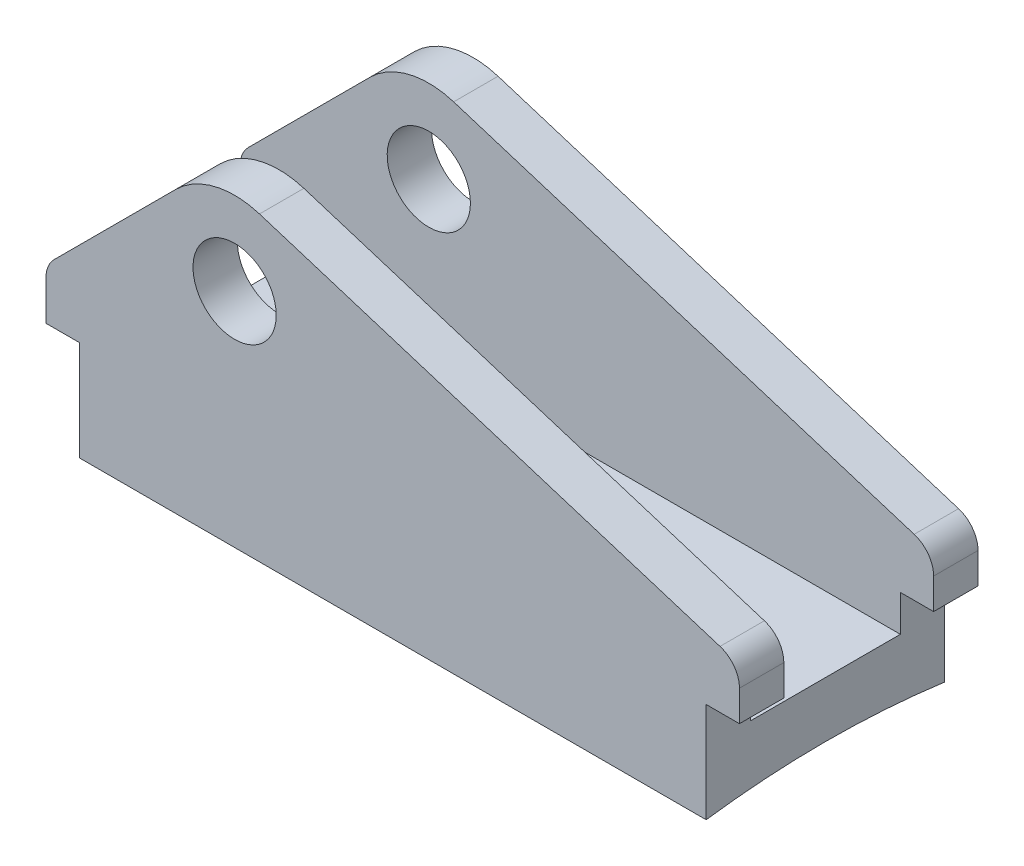
ISO-10303-21;
HEADER;
FILE_DESCRIPTION(('STEP AP214'),'2;1');
FILE_NAME('part.step','',(''),(''),'','','');
FILE_SCHEMA(('AUTOMOTIVE_DESIGN { 1 0 10303 214 1 1 1 1 }'));
ENDSEC;
DATA;
#1=APPLICATION_CONTEXT('core data for automotive mechanical design processes');
#2=APPLICATION_PROTOCOL_DEFINITION('international standard','automotive_design',2000,#1);
#3=PRODUCT_CONTEXT('',#1,'mechanical');
#4=PRODUCT('Part','Part','',(#3));
#5=PRODUCT_RELATED_PRODUCT_CATEGORY('part','',(#4));
#6=PRODUCT_DEFINITION_FORMATION('','',#4);
#7=PRODUCT_DEFINITION_CONTEXT('part definition',#1,'design');
#8=PRODUCT_DEFINITION('design','',#6,#7);
#9=PRODUCT_DEFINITION_SHAPE('','',#8);
#10=(LENGTH_UNIT() NAMED_UNIT(*) SI_UNIT(.MILLI.,.METRE.));
#11=(NAMED_UNIT(*) PLANE_ANGLE_UNIT() SI_UNIT($,.RADIAN.));
#12=(NAMED_UNIT(*) SI_UNIT($,.STERADIAN.) SOLID_ANGLE_UNIT());
#13=UNCERTAINTY_MEASURE_WITH_UNIT(LENGTH_MEASURE(1.E-05),#10,'distance_accuracy_value','');
#14=(GEOMETRIC_REPRESENTATION_CONTEXT(3) GLOBAL_UNCERTAINTY_ASSIGNED_CONTEXT((#13)) GLOBAL_UNIT_ASSIGNED_CONTEXT((#10,
#11,#12)) REPRESENTATION_CONTEXT('',''));
#15=CARTESIAN_POINT('',(0.,0.,0.));
#16=DIRECTION('',(0.,0.,1.));
#17=DIRECTION('',(1.,0.,0.));
#18=AXIS2_PLACEMENT_3D('',#15,#16,#17);
#19=CARTESIAN_POINT('',(0.,18.,-21.5));
#20=DIRECTION('',(0.,1.,0.));
#21=DIRECTION('',(0.,0.,1.));
#22=AXIS2_PLACEMENT_3D('',#19,#20,#21);
#23=PLANE('',#22);
#24=DIRECTION('',(1.,0.,0.));
#25=VECTOR('',#24,1.);
#26=CARTESIAN_POINT('',(0.,18.,-13.5));
#27=LINE('',#26,#25);
#28=CARTESIAN_POINT('',(-62.5,18.,-13.5));
#29=VERTEX_POINT('',#28);
#30=CARTESIAN_POINT('',(-56.5,18.,-13.5));
#31=VERTEX_POINT('',#30);
#32=EDGE_CURVE('E314',#29,#31,#27,.T.);
#33=ORIENTED_EDGE('',*,*,#32,.F.);
#34=DIRECTION('',(0.,0.,1.));
#35=VECTOR('',#34,1.);
#36=CARTESIAN_POINT('',(-62.5,18.,-21.5));
#37=LINE('',#36,#35);
#38=CARTESIAN_POINT('',(-62.5,18.,-21.5));
#39=VERTEX_POINT('',#38);
#40=EDGE_CURVE('E257',#39,#29,#37,.T.);
#41=ORIENTED_EDGE('',*,*,#40,.F.);
#42=DIRECTION('',(-1.,0.,0.));
#43=VECTOR('',#42,1.);
#44=CARTESIAN_POINT('',(0.,18.,-21.5));
#45=LINE('',#44,#43);
#46=CARTESIAN_POINT('',(-56.5,18.,-21.5));
#47=VERTEX_POINT('',#46);
#48=EDGE_CURVE('E65',#47,#39,#45,.T.);
#49=ORIENTED_EDGE('',*,*,#48,.F.);
#50=DIRECTION('',(0.,0.,1.));
#51=VECTOR('',#50,1.);
#52=CARTESIAN_POINT('',(-56.5,18.,-21.5));
#53=LINE('',#52,#51);
#54=EDGE_CURVE('E252',#47,#31,#53,.T.);
#55=ORIENTED_EDGE('',*,*,#54,.T.);
#56=EDGE_LOOP('',(#33,#41,#49,#55));
#57=FACE_BOUND('',#56,.T.);
#58=ADVANCED_FACE('F45',(#57),#23,.F.);
#59=CARTESIAN_POINT('',(-62.5,55.,21.5));
#60=DIRECTION('',(1.,0.,0.));
#61=DIRECTION('',(0.,0.,-1.));
#62=AXIS2_PLACEMENT_3D('',#59,#60,#61);
#63=PLANE('',#62);
#64=DIRECTION('',(0.,-1.,0.));
#65=VECTOR('',#64,1.);
#66=CARTESIAN_POINT('',(-62.5,0.,-13.5));
#67=LINE('',#66,#65);
#68=CARTESIAN_POINT('',(-62.5,25.1421356237309,-13.5));
#69=VERTEX_POINT('',#68);
#70=EDGE_CURVE('E469',#69,#29,#67,.T.);
#71=ORIENTED_EDGE('',*,*,#70,.F.);
#72=DIRECTION('',(0.,0.,1.));
#73=VECTOR('',#72,1.);
#74=CARTESIAN_POINT('',(-62.5,25.1421356237309,-21.5));
#75=LINE('',#74,#73);
#76=CARTESIAN_POINT('',(-62.5,25.1421356237309,-21.5));
#77=VERTEX_POINT('',#76);
#78=EDGE_CURVE('E262',#77,#69,#75,.T.);
#79=ORIENTED_EDGE('',*,*,#78,.F.);
#80=DIRECTION('',(0.,-1.,0.));
#81=VECTOR('',#80,1.);
#82=CARTESIAN_POINT('',(-62.5,55.,-21.5));
#83=LINE('',#82,#81);
#84=EDGE_CURVE('E293',#77,#39,#83,.T.);
#85=ORIENTED_EDGE('',*,*,#84,.T.);
#86=ORIENTED_EDGE('',*,*,#40,.T.);
#87=EDGE_LOOP('',(#71,#79,#85,#86));
#88=FACE_BOUND('',#87,.T.);
#89=ADVANCED_FACE('F520',(#88),#63,.F.);
#90=CARTESIAN_POINT('',(62.5,55.,21.5));
#91=DIRECTION('',(-1.,0.,0.));
#92=DIRECTION('',(0.,0.,1.));
#93=AXIS2_PLACEMENT_3D('',#90,#91,#92);
#94=PLANE('',#93);
#95=DIRECTION('',(0.,-1.,0.));
#96=VECTOR('',#95,1.);
#97=CARTESIAN_POINT('',(62.5,0.,-13.5));
#98=LINE('',#97,#96);
#99=CARTESIAN_POINT('',(62.5,23.5398697767776,-13.5));
#100=VERTEX_POINT('',#99);
#101=CARTESIAN_POINT('',(62.5,18.,-13.5));
#102=VERTEX_POINT('',#101);
#103=EDGE_CURVE('E205',#100,#102,#98,.T.);
#104=ORIENTED_EDGE('',*,*,#103,.T.);
#105=DIRECTION('',(0.,0.,1.));
#106=VECTOR('',#105,1.);
#107=CARTESIAN_POINT('',(62.5,18.,-21.5));
#108=LINE('',#107,#106);
#109=CARTESIAN_POINT('',(62.5,18.,-21.5));
#110=VERTEX_POINT('',#109);
#111=EDGE_CURVE('E241',#110,#102,#108,.T.);
#112=ORIENTED_EDGE('',*,*,#111,.F.);
#113=DIRECTION('',(0.,-1.,0.));
#114=VECTOR('',#113,1.);
#115=CARTESIAN_POINT('',(62.5,55.,-21.5));
#116=LINE('',#115,#114);
#117=CARTESIAN_POINT('',(62.5,23.5398697767776,-21.5));
#118=VERTEX_POINT('',#117);
#119=EDGE_CURVE('E54',#118,#110,#116,.T.);
#120=ORIENTED_EDGE('',*,*,#119,.F.);
#121=DIRECTION('',(0.,0.,1.));
#122=VECTOR('',#121,1.);
#123=CARTESIAN_POINT('',(62.5,23.5398697767776,-21.5));
#124=LINE('',#123,#122);
#125=EDGE_CURVE('E223',#118,#100,#124,.T.);
#126=ORIENTED_EDGE('',*,*,#125,.T.);
#127=EDGE_LOOP('',(#104,#112,#120,#126));
#128=FACE_BOUND('',#127,.T.);
#129=ADVANCED_FACE('F232',(#128),#94,.F.);
#130=CARTESIAN_POINT('',(0.,18.,-21.5));
#131=DIRECTION('',(0.,-1.,0.));
#132=DIRECTION('',(0.,0.,-1.));
#133=AXIS2_PLACEMENT_3D('',#130,#131,#132);
#134=PLANE('',#133);
#135=ORIENTED_EDGE('',*,*,#111,.T.);
#136=DIRECTION('',(-1.,0.,0.));
#137=VECTOR('',#136,1.);
#138=CARTESIAN_POINT('',(0.,18.,-13.5));
#139=LINE('',#138,#137);
#140=CARTESIAN_POINT('',(56.5,18.,-13.5));
#141=VERTEX_POINT('',#140);
#142=EDGE_CURVE('E212',#102,#141,#139,.T.);
#143=ORIENTED_EDGE('',*,*,#142,.T.);
#144=DIRECTION('',(0.,0.,1.));
#145=VECTOR('',#144,1.);
#146=CARTESIAN_POINT('',(56.5,18.,-21.5));
#147=LINE('',#146,#145);
#148=CARTESIAN_POINT('',(56.5,18.,-21.5));
#149=VERTEX_POINT('',#148);
#150=EDGE_CURVE('E247',#149,#141,#147,.T.);
#151=ORIENTED_EDGE('',*,*,#150,.F.);
#152=DIRECTION('',(1.,0.,0.));
#153=VECTOR('',#152,1.);
#154=CARTESIAN_POINT('',(0.,18.,-21.5));
#155=LINE('',#154,#153);
#156=EDGE_CURVE('E389',#149,#110,#155,.T.);
#157=ORIENTED_EDGE('',*,*,#156,.T.);
#158=EDGE_LOOP('',(#135,#143,#151,#157));
#159=FACE_BOUND('',#158,.T.);
#160=ADVANCED_FACE('F499',(#159),#134,.T.);
#161=CARTESIAN_POINT('',(-44.8566017177983,44.8566017177981,-21.5));
#162=DIRECTION('',(0.707106781186549,-0.707106781186546,0.));
#163=DIRECTION('',(0.707106781186546,0.707106781186549,0.));
#164=AXIS2_PLACEMENT_3D('',#161,#162,#163);
#165=PLANE('',#164);
#166=DIRECTION('',(-0.707106781186546,-0.707106781186549,0.));
#167=VECTOR('',#166,1.);
#168=CARTESIAN_POINT('',(-44.8566017177983,44.8566017177981,-13.5));
#169=LINE('',#168,#167);
#170=CARTESIAN_POINT('',(-39.1066017177982,50.6066017177982,-13.5));
#171=VERTEX_POINT('',#170);
#172=CARTESIAN_POINT('',(-61.0355339059327,28.6776695296636,-13.5));
#173=VERTEX_POINT('',#172);
#174=EDGE_CURVE('E228',#171,#173,#169,.T.);
#175=ORIENTED_EDGE('',*,*,#174,.F.);
#176=DIRECTION('',(0.,0.,1.));
#177=VECTOR('',#176,1.);
#178=CARTESIAN_POINT('',(-39.1066017177982,50.6066017177982,-21.5));
#179=LINE('',#178,#177);
#180=CARTESIAN_POINT('',(-39.1066017177982,50.6066017177982,-21.5));
#181=VERTEX_POINT('',#180);
#182=EDGE_CURVE('E272',#181,#171,#179,.T.);
#183=ORIENTED_EDGE('',*,*,#182,.F.);
#184=DIRECTION('',(0.707106781186546,0.707106781186549,0.));
#185=VECTOR('',#184,1.);
#186=CARTESIAN_POINT('',(-44.8566017177983,44.8566017177981,-21.5));
#187=LINE('',#186,#185);
#188=CARTESIAN_POINT('',(-61.0355339059327,28.6776695296636,-21.5));
#189=VERTEX_POINT('',#188);
#190=EDGE_CURVE('E373',#189,#181,#187,.T.);
#191=ORIENTED_EDGE('',*,*,#190,.F.);
#192=DIRECTION('',(0.,0.,1.));
#193=VECTOR('',#192,1.);
#194=CARTESIAN_POINT('',(-61.0355339059327,28.6776695296636,-21.5));
#195=LINE('',#194,#193);
#196=EDGE_CURVE('E267',#189,#173,#195,.T.);
#197=ORIENTED_EDGE('',*,*,#196,.T.);
#198=EDGE_LOOP('',(#175,#183,#191,#197));
#199=FACE_BOUND('',#198,.T.);
#200=ADVANCED_FACE('F511',(#199),#165,.F.);
#201=CARTESIAN_POINT('',(-57.5,25.1421356237309,-21.5));
#202=DIRECTION('',(0.,0.,1.));
#203=DIRECTION('',(1.,0.,0.));
#204=AXIS2_PLACEMENT_3D('',#201,#202,#203);
#205=CYLINDRICAL_SURFACE('',#204,5.);
#206=CARTESIAN_POINT('',(-57.5,25.1421356237309,-13.5));
#207=DIRECTION('',(0.,0.,1.));
#208=DIRECTION('',(0.,-1.,0.));
#209=AXIS2_PLACEMENT_3D('',#206,#207,#208);
#210=CIRCLE('',#209,5.);
#211=EDGE_CURVE('E488',#173,#69,#210,.T.);
#212=ORIENTED_EDGE('',*,*,#211,.F.);
#213=ORIENTED_EDGE('',*,*,#196,.F.);
#214=CARTESIAN_POINT('',(-57.5,25.1421356237309,-21.5));
#215=DIRECTION('',(0.,0.,1.));
#216=DIRECTION('',(1.,0.,0.));
#217=AXIS2_PLACEMENT_3D('',#214,#215,#216);
#218=CIRCLE('',#217,5.);
#219=EDGE_CURVE('E377',#77,#189,#218,.F.);
#220=ORIENTED_EDGE('',*,*,#219,.F.);
#221=ORIENTED_EDGE('',*,*,#78,.T.);
#222=EDGE_LOOP('',(#212,#213,#220,#221));
#223=FACE_BOUND('',#222,.T.);
#224=ADVANCED_FACE('F515',(#223),#205,.T.);
#225=CARTESIAN_POINT('',(57.5,23.5398697767776,-21.5));
#226=DIRECTION('',(0.,0.,1.));
#227=DIRECTION('',(1.,0.,0.));
#228=AXIS2_PLACEMENT_3D('',#225,#226,#227);
#229=CYLINDRICAL_SURFACE('',#228,5.);
#230=CARTESIAN_POINT('',(57.5,23.5398697767776,-13.5));
#231=DIRECTION('',(0.,0.,1.));
#232=DIRECTION('',(0.,-1.,0.));
#233=AXIS2_PLACEMENT_3D('',#230,#231,#232);
#234=CIRCLE('',#233,5.);
#235=CARTESIAN_POINT('',(58.9946232028037,28.3112533792184,-13.5));
#236=VERTEX_POINT('',#235);
#237=EDGE_CURVE('E209',#100,#236,#234,.T.);
#238=ORIENTED_EDGE('',*,*,#237,.F.);
#239=ORIENTED_EDGE('',*,*,#125,.F.);
#240=CARTESIAN_POINT('',(57.5,23.5398697767776,-21.5));
#241=DIRECTION('',(0.,0.,1.));
#242=DIRECTION('',(1.,0.,0.));
#243=AXIS2_PLACEMENT_3D('',#240,#241,#242);
#244=CIRCLE('',#243,5.);
#245=CARTESIAN_POINT('',(58.9946232028037,28.3112533792184,-21.5));
#246=VERTEX_POINT('',#245);
#247=EDGE_CURVE('E392',#246,#118,#244,.F.);
#248=ORIENTED_EDGE('',*,*,#247,.F.);
#249=DIRECTION('',(0.,0.,1.));
#250=VECTOR('',#249,1.);
#251=CARTESIAN_POINT('',(58.9946232028037,28.3112533792184,-21.5));
#252=LINE('',#251,#250);
#253=EDGE_CURVE('E226',#246,#236,#252,.T.);
#254=ORIENTED_EDGE('',*,*,#253,.T.);
#255=EDGE_LOOP('',(#238,#239,#248,#254));
#256=FACE_BOUND('',#255,.T.);
#257=ADVANCED_FACE('F222',(#256),#229,.T.);
#258=CARTESIAN_POINT('',(13.3474983241781,42.6100936464261,-21.5));
#259=DIRECTION('',(-0.298924640560751,-0.954276720488154,0.));
#260=DIRECTION('',(0.954276720488154,-0.298924640560751,0.));
#261=AXIS2_PLACEMENT_3D('',#258,#259,#260);
#262=PLANE('',#261);
#263=DIRECTION('',(-0.954276720488154,0.298924640560751,0.));
#264=VECTOR('',#263,1.);
#265=CARTESIAN_POINT('',(13.3474983241781,42.6100936464261,-13.5));
#266=LINE('',#265,#264);
#267=CARTESIAN_POINT('',(-24.0161303915887,54.3141508073223,-13.5));
#268=VERTEX_POINT('',#267);
#269=EDGE_CURVE('E229',#236,#268,#266,.T.);
#270=ORIENTED_EDGE('',*,*,#269,.F.);
#271=ORIENTED_EDGE('',*,*,#253,.F.);
#272=DIRECTION('',(0.954276720488154,-0.298924640560751,0.));
#273=VECTOR('',#272,1.);
#274=CARTESIAN_POINT('',(13.3474983241781,42.6100936464261,-21.5));
#275=LINE('',#274,#273);
#276=CARTESIAN_POINT('',(-24.0161303915887,54.3141508073223,-21.5));
#277=VERTEX_POINT('',#276);
#278=EDGE_CURVE('E395',#277,#246,#275,.T.);
#279=ORIENTED_EDGE('',*,*,#278,.F.);
#280=DIRECTION('',(0.,0.,1.));
#281=VECTOR('',#280,1.);
#282=CARTESIAN_POINT('',(-24.0161303915887,54.3141508073223,-21.5));
#283=LINE('',#282,#281);
#284=EDGE_CURVE('E281',#277,#268,#283,.T.);
#285=ORIENTED_EDGE('',*,*,#284,.T.);
#286=EDGE_LOOP('',(#270,#271,#279,#285));
#287=FACE_BOUND('',#286,.T.);
#288=ADVANCED_FACE('F505',(#287),#262,.F.);
#289=CARTESIAN_POINT('',(-28.5,40.,-21.5));
#290=DIRECTION('',(0.,0.,1.));
#291=DIRECTION('',(1.,0.,0.));
#292=AXIS2_PLACEMENT_3D('',#289,#290,#291);
#293=CYLINDRICAL_SURFACE('',#292,15.);
#294=CARTESIAN_POINT('',(-28.5,40.,-13.5));
#295=DIRECTION('',(0.,0.,1.));
#296=DIRECTION('',(0.,-1.,0.));
#297=AXIS2_PLACEMENT_3D('',#294,#295,#296);
#298=CIRCLE('',#297,15.);
#299=EDGE_CURVE('E301',#171,#268,#298,.F.);
#300=ORIENTED_EDGE('',*,*,#299,.T.);
#301=ORIENTED_EDGE('',*,*,#284,.F.);
#302=CARTESIAN_POINT('',(-28.5,40.,-21.5));
#303=DIRECTION('',(0.,0.,1.));
#304=DIRECTION('',(1.,0.,0.));
#305=AXIS2_PLACEMENT_3D('',#302,#303,#304);
#306=CIRCLE('',#305,15.);
#307=EDGE_CURVE('E369',#277,#181,#306,.T.);
#308=ORIENTED_EDGE('',*,*,#307,.T.);
#309=ORIENTED_EDGE('',*,*,#182,.T.);
#310=EDGE_LOOP('',(#300,#301,#308,#309));
#311=FACE_BOUND('',#310,.T.);
#312=ADVANCED_FACE('F513',(#311),#293,.T.);
#313=CARTESIAN_POINT('',(-28.5,40.,-21.5));
#314=DIRECTION('',(0.,0.,1.));
#315=DIRECTION('',(1.,0.,0.));
#316=AXIS2_PLACEMENT_3D('',#313,#314,#315);
#317=CYLINDRICAL_SURFACE('',#316,7.5);
#318=CARTESIAN_POINT('',(-28.5,40.,-21.5));
#319=DIRECTION('',(0.,0.,1.));
#320=DIRECTION('',(1.,0.,0.));
#321=AXIS2_PLACEMENT_3D('',#318,#319,#320);
#322=CIRCLE('',#321,7.5);
#323=CARTESIAN_POINT('',(-21.,40.,-21.5));
#324=VERTEX_POINT('',#323);
#325=EDGE_CURVE('E365',#324,#324,#322,.T.);
#326=ORIENTED_EDGE('',*,*,#325,.F.);
#327=EDGE_LOOP('',(#326));
#328=FACE_BOUND('',#327,.T.);
#329=CARTESIAN_POINT('',(-28.5,40.,-13.5));
#330=DIRECTION('',(0.,0.,1.));
#331=DIRECTION('',(0.,-1.,0.));
#332=AXIS2_PLACEMENT_3D('',#329,#330,#331);
#333=CIRCLE('',#332,7.5);
#334=CARTESIAN_POINT('',(-28.5,32.5,-13.5));
#335=VERTEX_POINT('',#334);
#336=EDGE_CURVE('E298',#335,#335,#333,.F.);
#337=ORIENTED_EDGE('',*,*,#336,.F.);
#338=EDGE_LOOP('',(#337));
#339=FACE_BOUND('',#338,.T.);
#340=ADVANCED_FACE('F570',(#328,#339),#317,.F.);
#341=CARTESIAN_POINT('',(-56.5,0.,-21.5));
#342=DIRECTION('',(1.,0.,0.));
#343=DIRECTION('',(0.,0.,-1.));
#344=AXIS2_PLACEMENT_3D('',#341,#342,#343);
#345=PLANE('',#344);
#346=CARTESIAN_POINT('',(-56.5,18.,13.5));
#347=VERTEX_POINT('',#346);
#348=CARTESIAN_POINT('',(-56.5,18.,21.5));
#349=VERTEX_POINT('',#348);
#350=EDGE_CURVE('E256',#347,#349,#53,.T.);
#351=ORIENTED_EDGE('',*,*,#350,.F.);
#352=DIRECTION('',(0.,-1.,0.));
#353=VECTOR('',#352,1.);
#354=CARTESIAN_POINT('',(-56.5,0.,13.5));
#355=LINE('',#354,#353);
#356=CARTESIAN_POINT('',(-56.5,11.4511116406047,13.5));
#357=VERTEX_POINT('',#356);
#358=EDGE_CURVE('E349',#347,#357,#355,.T.);
#359=ORIENTED_EDGE('',*,*,#358,.T.);
#360=DIRECTION('',(0.,0.,-1.));
#361=VECTOR('',#360,1.);
#362=CARTESIAN_POINT('',(-56.5,11.4511116406047,-21.5));
#363=LINE('',#362,#361);
#364=CARTESIAN_POINT('',(-56.5,11.4511116406047,-13.5));
#365=VERTEX_POINT('',#364);
#366=EDGE_CURVE('E353',#357,#365,#363,.T.);
#367=ORIENTED_EDGE('',*,*,#366,.T.);
#368=DIRECTION('',(0.,-1.,0.));
#369=VECTOR('',#368,1.);
#370=CARTESIAN_POINT('',(-56.5,0.,-13.5));
#371=LINE('',#370,#369);
#372=EDGE_CURVE('E307',#31,#365,#371,.T.);
#373=ORIENTED_EDGE('',*,*,#372,.F.);
#374=ORIENTED_EDGE('',*,*,#54,.F.);
#375=DIRECTION('',(0.,1.,0.));
#376=VECTOR('',#375,1.);
#377=CARTESIAN_POINT('',(-56.5,0.,-21.5));
#378=LINE('',#377,#376);
#379=CARTESIAN_POINT('',(-56.5,0.,-21.5));
#380=VERTEX_POINT('',#379);
#381=EDGE_CURVE('E61',#380,#47,#378,.T.);
#382=ORIENTED_EDGE('',*,*,#381,.F.);
#383=CARTESIAN_POINT('',(-56.5,-158.548888359395,0.));
#384=DIRECTION('',(1.,0.,0.));
#385=DIRECTION('',(0.,0.,-1.));
#386=AXIS2_PLACEMENT_3D('',#383,#384,#385);
#387=CIRCLE('',#386,160.);
#388=CARTESIAN_POINT('',(-56.5,0.,21.5));
#389=VERTEX_POINT('',#388);
#390=EDGE_CURVE('E360',#380,#389,#387,.T.);
#391=ORIENTED_EDGE('',*,*,#390,.T.);
#392=DIRECTION('',(0.,1.,0.));
#393=VECTOR('',#392,1.);
#394=CARTESIAN_POINT('',(-56.5,0.,21.5));
#395=LINE('',#394,#393);
#396=EDGE_CURVE('E418',#389,#349,#395,.T.);
#397=ORIENTED_EDGE('',*,*,#396,.T.);
#398=EDGE_LOOP('',(#351,#359,#367,#373,#374,#382,#391,#397));
#399=FACE_BOUND('',#398,.T.);
#400=ADVANCED_FACE('F526',(#399),#345,.F.);
#401=CARTESIAN_POINT('',(-62.5,18.,13.5));
#402=VERTEX_POINT('',#401);
#403=CARTESIAN_POINT('',(-62.5,18.,21.5));
#404=VERTEX_POINT('',#403);
#405=EDGE_CURVE('E261',#402,#404,#37,.T.);
#406=ORIENTED_EDGE('',*,*,#405,.F.);
#407=DIRECTION('',(1.,0.,0.));
#408=VECTOR('',#407,1.);
#409=CARTESIAN_POINT('',(0.,18.,13.5));
#410=LINE('',#409,#408);
#411=EDGE_CURVE('E345',#402,#347,#410,.T.);
#412=ORIENTED_EDGE('',*,*,#411,.T.);
#413=ORIENTED_EDGE('',*,*,#350,.T.);
#414=DIRECTION('',(-1.,0.,0.));
#415=VECTOR('',#414,1.);
#416=CARTESIAN_POINT('',(0.,18.,21.5));
#417=LINE('',#416,#415);
#418=EDGE_CURVE('E414',#349,#404,#417,.T.);
#419=ORIENTED_EDGE('',*,*,#418,.T.);
#420=EDGE_LOOP('',(#406,#412,#413,#419));
#421=FACE_BOUND('',#420,.T.);
#422=ADVANCED_FACE('F556',(#421),#23,.F.);
#423=CARTESIAN_POINT('',(-62.5,55.,-21.5));
#424=DIRECTION('',(0.,0.,1.));
#425=DIRECTION('',(1.,0.,0.));
#426=AXIS2_PLACEMENT_3D('',#423,#424,#425);
#427=PLANE('',#426);
#428=ORIENTED_EDGE('',*,*,#156,.F.);
#429=DIRECTION('',(0.,1.,0.));
#430=VECTOR('',#429,1.);
#431=CARTESIAN_POINT('',(56.5,0.,-21.5));
#432=LINE('',#431,#430);
#433=CARTESIAN_POINT('',(56.5,0.,-21.5));
#434=VERTEX_POINT('',#433);
#435=EDGE_CURVE('E385',#434,#149,#432,.T.);
#436=ORIENTED_EDGE('',*,*,#435,.F.);
#437=DIRECTION('',(-1.,0.,0.));
#438=VECTOR('',#437,1.);
#439=CARTESIAN_POINT('',(-62.5,0.,-21.5));
#440=LINE('',#439,#438);
#441=EDGE_CURVE('E277',#434,#380,#440,.T.);
#442=ORIENTED_EDGE('',*,*,#441,.T.);
#443=ORIENTED_EDGE('',*,*,#381,.T.);
#444=ORIENTED_EDGE('',*,*,#48,.T.);
#445=ORIENTED_EDGE('',*,*,#84,.F.);
#446=ORIENTED_EDGE('',*,*,#219,.T.);
#447=ORIENTED_EDGE('',*,*,#190,.T.);
#448=ORIENTED_EDGE('',*,*,#307,.F.);
#449=ORIENTED_EDGE('',*,*,#278,.T.);
#450=ORIENTED_EDGE('',*,*,#247,.T.);
#451=ORIENTED_EDGE('',*,*,#119,.T.);
#452=EDGE_LOOP('',(#428,#436,#442,#443,#444,#445,#446,#447,#448,#449,#450,#451));
#453=FACE_BOUND('',#452,.T.);
#454=ORIENTED_EDGE('',*,*,#325,.T.);
#455=EDGE_LOOP('',(#454));
#456=FACE_BOUND('',#455,.T.);
#457=ADVANCED_FACE('F501',(#453,#456),#427,.F.);
#458=CARTESIAN_POINT('',(-62.5,25.1421356237309,13.5));
#459=VERTEX_POINT('',#458);
#460=CARTESIAN_POINT('',(-62.5,25.1421356237309,21.5));
#461=VERTEX_POINT('',#460);
#462=EDGE_CURVE('E266',#459,#461,#75,.T.);
#463=ORIENTED_EDGE('',*,*,#462,.F.);
#464=DIRECTION('',(0.,-1.,0.));
#465=VECTOR('',#464,1.);
#466=CARTESIAN_POINT('',(-62.5,0.,13.5));
#467=LINE('',#466,#465);
#468=EDGE_CURVE('E472',#459,#402,#467,.T.);
#469=ORIENTED_EDGE('',*,*,#468,.T.);
#470=ORIENTED_EDGE('',*,*,#405,.T.);
#471=DIRECTION('',(0.,-1.,0.));
#472=VECTOR('',#471,1.);
#473=CARTESIAN_POINT('',(-62.5,55.,21.5));
#474=LINE('',#473,#472);
#475=EDGE_CURVE('E289',#461,#404,#474,.T.);
#476=ORIENTED_EDGE('',*,*,#475,.F.);
#477=EDGE_LOOP('',(#463,#469,#470,#476));
#478=FACE_BOUND('',#477,.T.);
#479=ADVANCED_FACE('F552',(#478),#63,.F.);
#480=CARTESIAN_POINT('',(-62.5,55.,21.5));
#481=DIRECTION('',(0.,0.,-1.));
#482=DIRECTION('',(-1.,0.,0.));
#483=AXIS2_PLACEMENT_3D('',#480,#481,#482);
#484=PLANE('',#483);
#485=DIRECTION('',(1.,0.,0.));
#486=VECTOR('',#485,1.);
#487=CARTESIAN_POINT('',(0.,18.,21.5));
#488=LINE('',#487,#486);
#489=CARTESIAN_POINT('',(56.5,18.,21.5));
#490=VERTEX_POINT('',#489);
#491=CARTESIAN_POINT('',(62.5,18.,21.5));
#492=VERTEX_POINT('',#491);
#493=EDGE_CURVE('E426',#490,#492,#488,.T.);
#494=ORIENTED_EDGE('',*,*,#493,.T.);
#495=DIRECTION('',(0.,-1.,0.));
#496=VECTOR('',#495,1.);
#497=CARTESIAN_POINT('',(62.5,55.,21.5));
#498=LINE('',#497,#496);
#499=CARTESIAN_POINT('',(62.5,23.5398697767776,21.5));
#500=VERTEX_POINT('',#499);
#501=EDGE_CURVE('E285',#500,#492,#498,.T.);
#502=ORIENTED_EDGE('',*,*,#501,.F.);
#503=CARTESIAN_POINT('',(57.5,23.5398697767776,21.5));
#504=DIRECTION('',(0.,0.,1.));
#505=DIRECTION('',(1.,0.,0.));
#506=AXIS2_PLACEMENT_3D('',#503,#504,#505);
#507=CIRCLE('',#506,5.);
#508=CARTESIAN_POINT('',(58.9946232028037,28.3112533792184,21.5));
#509=VERTEX_POINT('',#508);
#510=EDGE_CURVE('E430',#509,#500,#507,.F.);
#511=ORIENTED_EDGE('',*,*,#510,.F.);
#512=DIRECTION('',(0.954276720488154,-0.298924640560751,0.));
#513=VECTOR('',#512,1.);
#514=CARTESIAN_POINT('',(13.3474983241781,42.6100936464261,21.5));
#515=LINE('',#514,#513);
#516=CARTESIAN_POINT('',(-24.0161303915887,54.3141508073223,21.5));
#517=VERTEX_POINT('',#516);
#518=EDGE_CURVE('E370',#517,#509,#515,.T.);
#519=ORIENTED_EDGE('',*,*,#518,.F.);
#520=CARTESIAN_POINT('',(-28.5,40.,21.5));
#521=DIRECTION('',(0.,0.,1.));
#522=DIRECTION('',(1.,0.,0.));
#523=AXIS2_PLACEMENT_3D('',#520,#521,#522);
#524=CIRCLE('',#523,15.);
#525=CARTESIAN_POINT('',(-39.1066017177982,50.6066017177982,21.5));
#526=VERTEX_POINT('',#525);
#527=EDGE_CURVE('E402',#517,#526,#524,.T.);
#528=ORIENTED_EDGE('',*,*,#527,.T.);
#529=DIRECTION('',(0.707106781186546,0.707106781186549,0.));
#530=VECTOR('',#529,1.);
#531=CARTESIAN_POINT('',(-44.8566017177983,44.8566017177981,21.5));
#532=LINE('',#531,#530);
#533=CARTESIAN_POINT('',(-61.0355339059327,28.6776695296636,21.5));
#534=VERTEX_POINT('',#533);
#535=EDGE_CURVE('E406',#534,#526,#532,.T.);
#536=ORIENTED_EDGE('',*,*,#535,.F.);
#537=CARTESIAN_POINT('',(-57.5,25.1421356237309,21.5));
#538=DIRECTION('',(0.,0.,1.));
#539=DIRECTION('',(1.,0.,0.));
#540=AXIS2_PLACEMENT_3D('',#537,#538,#539);
#541=CIRCLE('',#540,5.);
#542=EDGE_CURVE('E410',#461,#534,#541,.F.);
#543=ORIENTED_EDGE('',*,*,#542,.F.);
#544=ORIENTED_EDGE('',*,*,#475,.T.);
#545=ORIENTED_EDGE('',*,*,#418,.F.);
#546=ORIENTED_EDGE('',*,*,#396,.F.);
#547=DIRECTION('',(1.,0.,0.));
#548=VECTOR('',#547,1.);
#549=CARTESIAN_POINT('',(-62.5,0.,21.5));
#550=LINE('',#549,#548);
#551=CARTESIAN_POINT('',(56.5,0.,21.5));
#552=VERTEX_POINT('',#551);
#553=EDGE_CURVE('E280',#389,#552,#550,.T.);
#554=ORIENTED_EDGE('',*,*,#553,.T.);
#555=DIRECTION('',(0.,1.,0.));
#556=VECTOR('',#555,1.);
#557=CARTESIAN_POINT('',(56.5,0.,21.5));
#558=LINE('',#557,#556);
#559=EDGE_CURVE('E422',#552,#490,#558,.T.);
#560=ORIENTED_EDGE('',*,*,#559,.T.);
#561=EDGE_LOOP('',(#494,#502,#511,#519,#528,#536,#543,#544,#545,#546,#554,#560));
#562=FACE_BOUND('',#561,.T.);
#563=CARTESIAN_POINT('',(-28.5,40.,21.5));
#564=DIRECTION('',(0.,0.,1.));
#565=DIRECTION('',(1.,0.,0.));
#566=AXIS2_PLACEMENT_3D('',#563,#564,#565);
#567=CIRCLE('',#566,7.5);
#568=CARTESIAN_POINT('',(-21.,40.,21.5));
#569=VERTEX_POINT('',#568);
#570=EDGE_CURVE('E364',#569,#569,#567,.T.);
#571=ORIENTED_EDGE('',*,*,#570,.F.);
#572=EDGE_LOOP('',(#571));
#573=FACE_BOUND('',#572,.T.);
#574=ADVANCED_FACE('F456',(#562,#573),#484,.F.);
#575=CARTESIAN_POINT('',(62.5,18.,13.5));
#576=VERTEX_POINT('',#575);
#577=EDGE_CURVE('E246',#576,#492,#108,.T.);
#578=ORIENTED_EDGE('',*,*,#577,.F.);
#579=DIRECTION('',(0.,-1.,0.));
#580=VECTOR('',#579,1.);
#581=CARTESIAN_POINT('',(62.5,0.,13.5));
#582=LINE('',#581,#580);
#583=CARTESIAN_POINT('',(62.5,23.5398697767776,13.5));
#584=VERTEX_POINT('',#583);
#585=EDGE_CURVE('E218',#584,#576,#582,.T.);
#586=ORIENTED_EDGE('',*,*,#585,.F.);
#587=EDGE_CURVE('E236',#584,#500,#124,.T.);
#588=ORIENTED_EDGE('',*,*,#587,.T.);
#589=ORIENTED_EDGE('',*,*,#501,.T.);
#590=EDGE_LOOP('',(#578,#586,#588,#589));
#591=FACE_BOUND('',#590,.T.);
#592=ADVANCED_FACE('F47',(#591),#94,.F.);
#593=CARTESIAN_POINT('',(56.5,0.,-21.5));
#594=DIRECTION('',(1.,0.,0.));
#595=DIRECTION('',(0.,0.,-1.));
#596=AXIS2_PLACEMENT_3D('',#593,#594,#595);
#597=PLANE('',#596);
#598=DIRECTION('',(0.,-1.,0.));
#599=VECTOR('',#598,1.);
#600=CARTESIAN_POINT('',(56.5,0.,13.5));
#601=LINE('',#600,#599);
#602=CARTESIAN_POINT('',(56.5,18.,13.5));
#603=VERTEX_POINT('',#602);
#604=CARTESIAN_POINT('',(56.5,11.4511116406047,13.5));
#605=VERTEX_POINT('',#604);
#606=EDGE_CURVE('E342',#603,#605,#601,.T.);
#607=ORIENTED_EDGE('',*,*,#606,.F.);
#608=EDGE_CURVE('E251',#603,#490,#147,.T.);
#609=ORIENTED_EDGE('',*,*,#608,.T.);
#610=ORIENTED_EDGE('',*,*,#559,.F.);
#611=CARTESIAN_POINT('',(56.5,-158.548888359395,0.));
#612=DIRECTION('',(1.,0.,0.));
#613=DIRECTION('',(0.,0.,-1.));
#614=AXIS2_PLACEMENT_3D('',#611,#612,#613);
#615=CIRCLE('',#614,160.);
#616=EDGE_CURVE('E357',#434,#552,#615,.T.);
#617=ORIENTED_EDGE('',*,*,#616,.F.);
#618=ORIENTED_EDGE('',*,*,#435,.T.);
#619=ORIENTED_EDGE('',*,*,#150,.T.);
#620=DIRECTION('',(0.,-1.,0.));
#621=VECTOR('',#620,1.);
#622=CARTESIAN_POINT('',(56.5,0.,-13.5));
#623=LINE('',#622,#621);
#624=CARTESIAN_POINT('',(56.5,11.4511116406047,-13.5));
#625=VERTEX_POINT('',#624);
#626=EDGE_CURVE('E320',#141,#625,#623,.T.);
#627=ORIENTED_EDGE('',*,*,#626,.T.);
#628=DIRECTION('',(0.,0.,-1.));
#629=VECTOR('',#628,1.);
#630=CARTESIAN_POINT('',(56.5,11.4511116406047,-21.5));
#631=LINE('',#630,#629);
#632=EDGE_CURVE('E11',#605,#625,#631,.T.);
#633=ORIENTED_EDGE('',*,*,#632,.F.);
#634=EDGE_LOOP('',(#607,#609,#610,#617,#618,#619,#627,#633));
#635=FACE_BOUND('',#634,.T.);
#636=ADVANCED_FACE('F497',(#635),#597,.T.);
#637=DIRECTION('',(-1.,0.,0.));
#638=VECTOR('',#637,1.);
#639=CARTESIAN_POINT('',(0.,18.,13.5));
#640=LINE('',#639,#638);
#641=EDGE_CURVE('E339',#576,#603,#640,.T.);
#642=ORIENTED_EDGE('',*,*,#641,.F.);
#643=ORIENTED_EDGE('',*,*,#577,.T.);
#644=ORIENTED_EDGE('',*,*,#493,.F.);
#645=ORIENTED_EDGE('',*,*,#608,.F.);
#646=EDGE_LOOP('',(#642,#643,#644,#645));
#647=FACE_BOUND('',#646,.T.);
#648=ADVANCED_FACE('F534',(#647),#134,.T.);
#649=CARTESIAN_POINT('',(-39.1066017177982,50.6066017177982,13.5));
#650=VERTEX_POINT('',#649);
#651=EDGE_CURVE('E276',#650,#526,#179,.T.);
#652=ORIENTED_EDGE('',*,*,#651,.F.);
#653=DIRECTION('',(-0.707106781186546,-0.707106781186549,0.));
#654=VECTOR('',#653,1.);
#655=CARTESIAN_POINT('',(-44.8566017177983,44.8566017177981,13.5));
#656=LINE('',#655,#654);
#657=CARTESIAN_POINT('',(-61.0355339059327,28.6776695296636,13.5));
#658=VERTEX_POINT('',#657);
#659=EDGE_CURVE('E331',#650,#658,#656,.T.);
#660=ORIENTED_EDGE('',*,*,#659,.T.);
#661=EDGE_CURVE('E271',#658,#534,#195,.T.);
#662=ORIENTED_EDGE('',*,*,#661,.T.);
#663=ORIENTED_EDGE('',*,*,#535,.T.);
#664=EDGE_LOOP('',(#652,#660,#662,#663));
#665=FACE_BOUND('',#664,.T.);
#666=ADVANCED_FACE('F544',(#665),#165,.F.);
#667=ORIENTED_EDGE('',*,*,#661,.F.);
#668=CARTESIAN_POINT('',(-57.5,25.1421356237309,13.5));
#669=DIRECTION('',(0.,0.,1.));
#670=DIRECTION('',(0.,-1.,0.));
#671=AXIS2_PLACEMENT_3D('',#668,#669,#670);
#672=CIRCLE('',#671,5.);
#673=EDGE_CURVE('E335',#658,#459,#672,.T.);
#674=ORIENTED_EDGE('',*,*,#673,.T.);
#675=ORIENTED_EDGE('',*,*,#462,.T.);
#676=ORIENTED_EDGE('',*,*,#542,.T.);
#677=EDGE_LOOP('',(#667,#674,#675,#676));
#678=FACE_BOUND('',#677,.T.);
#679=ADVANCED_FACE('F547',(#678),#205,.T.);
#680=ORIENTED_EDGE('',*,*,#587,.F.);
#681=CARTESIAN_POINT('',(57.5,23.5398697767776,13.5));
#682=DIRECTION('',(0.,0.,1.));
#683=DIRECTION('',(0.,-1.,0.));
#684=AXIS2_PLACEMENT_3D('',#681,#682,#683);
#685=CIRCLE('',#684,5.);
#686=CARTESIAN_POINT('',(58.9946232028037,28.3112533792184,13.5));
#687=VERTEX_POINT('',#686);
#688=EDGE_CURVE('E327',#584,#687,#685,.T.);
#689=ORIENTED_EDGE('',*,*,#688,.T.);
#690=EDGE_CURVE('E235',#687,#509,#252,.T.);
#691=ORIENTED_EDGE('',*,*,#690,.T.);
#692=ORIENTED_EDGE('',*,*,#510,.T.);
#693=EDGE_LOOP('',(#680,#689,#691,#692));
#694=FACE_BOUND('',#693,.T.);
#695=ADVANCED_FACE('F461',(#694),#229,.T.);
#696=ORIENTED_EDGE('',*,*,#690,.F.);
#697=DIRECTION('',(-0.954276720488154,0.298924640560751,0.));
#698=VECTOR('',#697,1.);
#699=CARTESIAN_POINT('',(13.3474983241781,42.6100936464261,13.5));
#700=LINE('',#699,#698);
#701=CARTESIAN_POINT('',(-24.0161303915887,54.3141508073223,13.5));
#702=VERTEX_POINT('',#701);
#703=EDGE_CURVE('E312',#687,#702,#700,.T.);
#704=ORIENTED_EDGE('',*,*,#703,.T.);
#705=EDGE_CURVE('E438',#702,#517,#283,.T.);
#706=ORIENTED_EDGE('',*,*,#705,.T.);
#707=ORIENTED_EDGE('',*,*,#518,.T.);
#708=EDGE_LOOP('',(#696,#704,#706,#707));
#709=FACE_BOUND('',#708,.T.);
#710=ADVANCED_FACE('F447',(#709),#262,.F.);
#711=ORIENTED_EDGE('',*,*,#705,.F.);
#712=CARTESIAN_POINT('',(-28.5,40.,13.5));
#713=DIRECTION('',(0.,0.,1.));
#714=DIRECTION('',(0.,-1.,0.));
#715=AXIS2_PLACEMENT_3D('',#712,#713,#714);
#716=CIRCLE('',#715,15.);
#717=EDGE_CURVE('E306',#650,#702,#716,.F.);
#718=ORIENTED_EDGE('',*,*,#717,.F.);
#719=ORIENTED_EDGE('',*,*,#651,.T.);
#720=ORIENTED_EDGE('',*,*,#527,.F.);
#721=EDGE_LOOP('',(#711,#718,#719,#720));
#722=FACE_BOUND('',#721,.T.);
#723=ADVANCED_FACE('F452',(#722),#293,.T.);
#724=CARTESIAN_POINT('',(-28.5,40.,13.5));
#725=DIRECTION('',(0.,0.,1.));
#726=DIRECTION('',(0.,-1.,0.));
#727=AXIS2_PLACEMENT_3D('',#724,#725,#726);
#728=CIRCLE('',#727,7.5);
#729=CARTESIAN_POINT('',(-28.5,32.5,13.5));
#730=VERTEX_POINT('',#729);
#731=EDGE_CURVE('E303',#730,#730,#728,.F.);
#732=ORIENTED_EDGE('',*,*,#731,.T.);
#733=EDGE_LOOP('',(#732));
#734=FACE_BOUND('',#733,.T.);
#735=ORIENTED_EDGE('',*,*,#570,.T.);
#736=EDGE_LOOP('',(#735));
#737=FACE_BOUND('',#736,.T.);
#738=ADVANCED_FACE('F562',(#734,#737),#317,.F.);
#739=CARTESIAN_POINT('',(-62.5,-158.548888359395,0.));
#740=DIRECTION('',(1.,0.,0.));
#741=DIRECTION('',(0.,0.,-1.));
#742=AXIS2_PLACEMENT_3D('',#739,#740,#741);
#743=CYLINDRICAL_SURFACE('',#742,160.);
#744=ORIENTED_EDGE('',*,*,#441,.F.);
#745=ORIENTED_EDGE('',*,*,#616,.T.);
#746=ORIENTED_EDGE('',*,*,#553,.F.);
#747=ORIENTED_EDGE('',*,*,#390,.F.);
#748=EDGE_LOOP('',(#744,#745,#746,#747));
#749=FACE_BOUND('',#748,.T.);
#750=ADVANCED_FACE('F559',(#749),#743,.F.);
#751=CARTESIAN_POINT('',(-62.5,11.4511116406047,0.));
#752=DIRECTION('',(0.,-1.,0.));
#753=DIRECTION('',(0.,0.,-1.));
#754=AXIS2_PLACEMENT_3D('',#751,#752,#753);
#755=PLANE('',#754);
#756=DIRECTION('',(1.,0.,0.));
#757=VECTOR('',#756,1.);
#758=CARTESIAN_POINT('',(-62.5,11.4511116406047,13.5));
#759=LINE('',#758,#757);
#760=EDGE_CURVE('E302',#357,#605,#759,.T.);
#761=ORIENTED_EDGE('',*,*,#760,.T.);
#762=ORIENTED_EDGE('',*,*,#632,.T.);
#763=DIRECTION('',(1.,0.,0.));
#764=VECTOR('',#763,1.);
#765=CARTESIAN_POINT('',(-62.5,11.4511116406047,-13.5));
#766=LINE('',#765,#764);
#767=EDGE_CURVE('E479',#365,#625,#766,.T.);
#768=ORIENTED_EDGE('',*,*,#767,.F.);
#769=ORIENTED_EDGE('',*,*,#366,.F.);
#770=EDGE_LOOP('',(#761,#762,#768,#769));
#771=FACE_BOUND('',#770,.T.);
#772=ADVANCED_FACE('F529',(#771),#755,.F.);
#773=CARTESIAN_POINT('',(-62.5,0.,13.5));
#774=DIRECTION('',(0.,0.,1.));
#775=DIRECTION('',(0.,-1.,0.));
#776=AXIS2_PLACEMENT_3D('',#773,#774,#775);
#777=PLANE('',#776);
#778=ORIENTED_EDGE('',*,*,#731,.F.);
#779=EDGE_LOOP('',(#778));
#780=FACE_BOUND('',#779,.T.);
#781=ORIENTED_EDGE('',*,*,#411,.F.);
#782=ORIENTED_EDGE('',*,*,#468,.F.);
#783=ORIENTED_EDGE('',*,*,#673,.F.);
#784=ORIENTED_EDGE('',*,*,#659,.F.);
#785=ORIENTED_EDGE('',*,*,#717,.T.);
#786=ORIENTED_EDGE('',*,*,#703,.F.);
#787=ORIENTED_EDGE('',*,*,#688,.F.);
#788=ORIENTED_EDGE('',*,*,#585,.T.);
#789=ORIENTED_EDGE('',*,*,#641,.T.);
#790=ORIENTED_EDGE('',*,*,#606,.T.);
#791=ORIENTED_EDGE('',*,*,#760,.F.);
#792=ORIENTED_EDGE('',*,*,#358,.F.);
#793=EDGE_LOOP('',(#781,#782,#783,#784,#785,#786,#787,#788,#789,#790,#791,#792));
#794=FACE_BOUND('',#793,.T.);
#795=ADVANCED_FACE('F464',(#780,#794),#777,.F.);
#796=CARTESIAN_POINT('',(-62.5,0.,-13.5));
#797=DIRECTION('',(0.,0.,1.));
#798=DIRECTION('',(0.,-1.,0.));
#799=AXIS2_PLACEMENT_3D('',#796,#797,#798);
#800=PLANE('',#799);
#801=ORIENTED_EDGE('',*,*,#336,.T.);
#802=EDGE_LOOP('',(#801));
#803=FACE_BOUND('',#802,.T.);
#804=ORIENTED_EDGE('',*,*,#372,.T.);
#805=ORIENTED_EDGE('',*,*,#767,.T.);
#806=ORIENTED_EDGE('',*,*,#626,.F.);
#807=ORIENTED_EDGE('',*,*,#142,.F.);
#808=ORIENTED_EDGE('',*,*,#103,.F.);
#809=ORIENTED_EDGE('',*,*,#237,.T.);
#810=ORIENTED_EDGE('',*,*,#269,.T.);
#811=ORIENTED_EDGE('',*,*,#299,.F.);
#812=ORIENTED_EDGE('',*,*,#174,.T.);
#813=ORIENTED_EDGE('',*,*,#211,.T.);
#814=ORIENTED_EDGE('',*,*,#70,.T.);
#815=ORIENTED_EDGE('',*,*,#32,.T.);
#816=EDGE_LOOP('',(#804,#805,#806,#807,#808,#809,#810,#811,#812,#813,#814,#815));
#817=FACE_BOUND('',#816,.T.);
#818=ADVANCED_FACE('F207',(#803,#817),#800,.T.);
#819=CLOSED_SHELL('',(#58,#89,#129,#160,#200,#224,#257,#288,#312,#340,#400,#422,#457,#479,#574,
#592,#636,#648,#666,#679,#695,#710,#723,#738,#750,#772,#795,#818));
#820=MANIFOLD_SOLID_BREP('B2',#819);
#821=ADVANCED_BREP_SHAPE_REPRESENTATION('',(#18,#820),#14);
#822=SHAPE_DEFINITION_REPRESENTATION(#9,#821);
ENDSEC;
END-ISO-10303-21;
